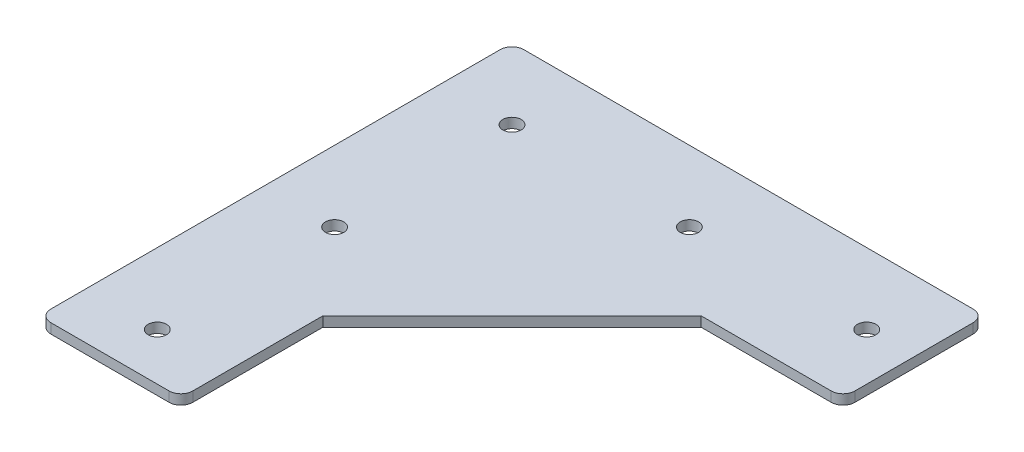
ISO-10303-21;
HEADER;
FILE_DESCRIPTION(('STEP AP214'),'2;1');
FILE_NAME('part.step','',(''),(''),'','','');
FILE_SCHEMA(('AUTOMOTIVE_DESIGN { 1 0 10303 214 1 1 1 1 }'));
ENDSEC;
DATA;
#1=APPLICATION_CONTEXT('core data for automotive mechanical design processes');
#2=APPLICATION_PROTOCOL_DEFINITION('international standard','automotive_design',2000,#1);
#3=PRODUCT_CONTEXT('',#1,'mechanical');
#4=PRODUCT('Part','Part','',(#3));
#5=PRODUCT_RELATED_PRODUCT_CATEGORY('part','',(#4));
#6=PRODUCT_DEFINITION_FORMATION('','',#4);
#7=PRODUCT_DEFINITION_CONTEXT('part definition',#1,'design');
#8=PRODUCT_DEFINITION('design','',#6,#7);
#9=PRODUCT_DEFINITION_SHAPE('','',#8);
#10=(LENGTH_UNIT() NAMED_UNIT(*) SI_UNIT(.MILLI.,.METRE.));
#11=(NAMED_UNIT(*) PLANE_ANGLE_UNIT() SI_UNIT($,.RADIAN.));
#12=(NAMED_UNIT(*) SI_UNIT($,.STERADIAN.) SOLID_ANGLE_UNIT());
#13=UNCERTAINTY_MEASURE_WITH_UNIT(LENGTH_MEASURE(1.E-05),#10,'distance_accuracy_value','');
#14=(GEOMETRIC_REPRESENTATION_CONTEXT(3) GLOBAL_UNCERTAINTY_ASSIGNED_CONTEXT((#13)) GLOBAL_UNIT_ASSIGNED_CONTEXT((#10,
#11,#12)) REPRESENTATION_CONTEXT('',''));
#15=CARTESIAN_POINT('',(0.,0.,0.));
#16=DIRECTION('',(0.,0.,1.));
#17=DIRECTION('',(1.,0.,0.));
#18=AXIS2_PLACEMENT_3D('',#15,#16,#17);
#19=CARTESIAN_POINT('',(127.,2.65684,0.));
#20=DIRECTION('',(-1.,0.,0.));
#21=DIRECTION('',(0.,0.,1.));
#22=AXIS2_PLACEMENT_3D('',#19,#20,#21);
#23=PLANE('',#22);
#24=DIRECTION('',(0.,0.,-1.));
#25=VECTOR('',#24,1.);
#26=CARTESIAN_POINT('',(127.,0.,0.));
#27=LINE('',#26,#25);
#28=CARTESIAN_POINT('',(127.,0.,-92.075));
#29=VERTEX_POINT('',#28);
#30=CARTESIAN_POINT('',(127.,0.,-123.825));
#31=VERTEX_POINT('',#30);
#32=EDGE_CURVE('E154',#29,#31,#27,.T.);
#33=ORIENTED_EDGE('',*,*,#32,.T.);
#34=DIRECTION('',(0.,-1.,0.));
#35=VECTOR('',#34,1.);
#36=CARTESIAN_POINT('',(127.,2.65684,-123.825));
#37=LINE('',#36,#35);
#38=CARTESIAN_POINT('',(127.,2.65684,-123.825));
#39=VERTEX_POINT('',#38);
#40=EDGE_CURVE('E205',#31,#39,#37,.F.);
#41=ORIENTED_EDGE('',*,*,#40,.T.);
#42=DIRECTION('',(0.,0.,-1.));
#43=VECTOR('',#42,1.);
#44=CARTESIAN_POINT('',(127.,2.65684,0.));
#45=LINE('',#44,#43);
#46=CARTESIAN_POINT('',(127.,2.65684,-92.075));
#47=VERTEX_POINT('',#46);
#48=EDGE_CURVE('E172',#47,#39,#45,.T.);
#49=ORIENTED_EDGE('',*,*,#48,.F.);
#50=DIRECTION('',(0.,-1.,0.));
#51=VECTOR('',#50,1.);
#52=CARTESIAN_POINT('',(127.,2.65684,-92.075));
#53=LINE('',#52,#51);
#54=EDGE_CURVE('E202',#47,#29,#53,.T.);
#55=ORIENTED_EDGE('',*,*,#54,.T.);
#56=EDGE_LOOP('',(#33,#41,#49,#55));
#57=FACE_BOUND('',#56,.T.);
#58=ADVANCED_FACE('F37',(#57),#23,.F.);
#59=CARTESIAN_POINT('',(0.,2.65684,-127.));
#60=DIRECTION('',(0.,0.,1.));
#61=DIRECTION('',(1.,0.,0.));
#62=AXIS2_PLACEMENT_3D('',#59,#60,#61);
#63=PLANE('',#62);
#64=DIRECTION('',(-1.,0.,0.));
#65=VECTOR('',#64,1.);
#66=CARTESIAN_POINT('',(0.,0.,-127.));
#67=LINE('',#66,#65);
#68=CARTESIAN_POINT('',(123.825,0.,-127.));
#69=VERTEX_POINT('',#68);
#70=CARTESIAN_POINT('',(3.175,0.,-127.));
#71=VERTEX_POINT('',#70);
#72=EDGE_CURVE('E157',#69,#71,#67,.T.);
#73=ORIENTED_EDGE('',*,*,#72,.T.);
#74=DIRECTION('',(0.,-1.,0.));
#75=VECTOR('',#74,1.);
#76=CARTESIAN_POINT('',(3.175,2.65684,-127.));
#77=LINE('',#76,#75);
#78=CARTESIAN_POINT('',(3.175,2.65684,-127.));
#79=VERTEX_POINT('',#78);
#80=EDGE_CURVE('E191',#71,#79,#77,.F.);
#81=ORIENTED_EDGE('',*,*,#80,.T.);
#82=DIRECTION('',(-1.,0.,0.));
#83=VECTOR('',#82,1.);
#84=CARTESIAN_POINT('',(0.,2.65684,-127.));
#85=LINE('',#84,#83);
#86=CARTESIAN_POINT('',(123.825,2.65684,-127.));
#87=VERTEX_POINT('',#86);
#88=EDGE_CURVE('E225',#87,#79,#85,.T.);
#89=ORIENTED_EDGE('',*,*,#88,.F.);
#90=DIRECTION('',(0.,-1.,0.));
#91=VECTOR('',#90,1.);
#92=CARTESIAN_POINT('',(123.825,2.65684,-127.));
#93=LINE('',#92,#91);
#94=EDGE_CURVE('E188',#87,#69,#93,.T.);
#95=ORIENTED_EDGE('',*,*,#94,.T.);
#96=EDGE_LOOP('',(#73,#81,#89,#95));
#97=FACE_BOUND('',#96,.T.);
#98=ADVANCED_FACE('F291',(#97),#63,.F.);
#99=CARTESIAN_POINT('',(0.,2.65684,0.));
#100=DIRECTION('',(-1.,0.,0.));
#101=DIRECTION('',(0.,0.,1.));
#102=AXIS2_PLACEMENT_3D('',#99,#100,#101);
#103=PLANE('',#102);
#104=DIRECTION('',(0.,0.,-1.));
#105=VECTOR('',#104,1.);
#106=CARTESIAN_POINT('',(0.,2.65684,0.));
#107=LINE('',#106,#105);
#108=CARTESIAN_POINT('',(0.,2.65684,-3.175));
#109=VERTEX_POINT('',#108);
#110=CARTESIAN_POINT('',(0.,2.65684,-123.825));
#111=VERTEX_POINT('',#110);
#112=EDGE_CURVE('E223',#109,#111,#107,.T.);
#113=ORIENTED_EDGE('',*,*,#112,.T.);
#114=DIRECTION('',(0.,-1.,0.));
#115=VECTOR('',#114,1.);
#116=CARTESIAN_POINT('',(0.,0.,-123.825));
#117=LINE('',#116,#115);
#118=CARTESIAN_POINT('',(0.,0.,-123.825));
#119=VERTEX_POINT('',#118);
#120=EDGE_CURVE('E175',#111,#119,#117,.T.);
#121=ORIENTED_EDGE('',*,*,#120,.T.);
#122=DIRECTION('',(0.,0.,-1.));
#123=VECTOR('',#122,1.);
#124=CARTESIAN_POINT('',(0.,0.,0.));
#125=LINE('',#124,#123);
#126=CARTESIAN_POINT('',(0.,0.,-3.175));
#127=VERTEX_POINT('',#126);
#128=EDGE_CURVE('E161',#127,#119,#125,.T.);
#129=ORIENTED_EDGE('',*,*,#128,.F.);
#130=DIRECTION('',(0.,-1.,0.));
#131=VECTOR('',#130,1.);
#132=CARTESIAN_POINT('',(0.,2.65684,-3.175));
#133=LINE('',#132,#131);
#134=EDGE_CURVE('E145',#127,#109,#133,.F.);
#135=ORIENTED_EDGE('',*,*,#134,.T.);
#136=EDGE_LOOP('',(#113,#121,#129,#135));
#137=FACE_BOUND('',#136,.T.);
#138=ADVANCED_FACE('F297',(#137),#103,.T.);
#139=CARTESIAN_POINT('',(0.,2.65684,0.));
#140=DIRECTION('',(0.,0.,-1.));
#141=DIRECTION('',(-1.,0.,0.));
#142=AXIS2_PLACEMENT_3D('',#139,#140,#141);
#143=PLANE('',#142);
#144=DIRECTION('',(1.,0.,0.));
#145=VECTOR('',#144,1.);
#146=CARTESIAN_POINT('',(0.,2.65684,0.));
#147=LINE('',#146,#145);
#148=CARTESIAN_POINT('',(3.175,2.65684,0.));
#149=VERTEX_POINT('',#148);
#150=CARTESIAN_POINT('',(34.925,2.65684,0.));
#151=VERTEX_POINT('',#150);
#152=EDGE_CURVE('E135',#149,#151,#147,.T.);
#153=ORIENTED_EDGE('',*,*,#152,.F.);
#154=DIRECTION('',(0.,-1.,0.));
#155=VECTOR('',#154,1.);
#156=CARTESIAN_POINT('',(3.175,0.,0.));
#157=LINE('',#156,#155);
#158=CARTESIAN_POINT('',(3.175,0.,0.));
#159=VERTEX_POINT('',#158);
#160=EDGE_CURVE('E45',#149,#159,#157,.T.);
#161=ORIENTED_EDGE('',*,*,#160,.T.);
#162=DIRECTION('',(1.,0.,0.));
#163=VECTOR('',#162,1.);
#164=CARTESIAN_POINT('',(0.,0.,0.));
#165=LINE('',#164,#163);
#166=CARTESIAN_POINT('',(34.925,0.,0.));
#167=VERTEX_POINT('',#166);
#168=EDGE_CURVE('E164',#159,#167,#165,.T.);
#169=ORIENTED_EDGE('',*,*,#168,.T.);
#170=DIRECTION('',(0.,-1.,0.));
#171=VECTOR('',#170,1.);
#172=CARTESIAN_POINT('',(34.925,2.65684,0.));
#173=LINE('',#172,#171);
#174=EDGE_CURVE('E208',#167,#151,#173,.F.);
#175=ORIENTED_EDGE('',*,*,#174,.T.);
#176=EDGE_LOOP('',(#153,#161,#169,#175));
#177=FACE_BOUND('',#176,.T.);
#178=ADVANCED_FACE('F214',(#177),#143,.F.);
#179=CARTESIAN_POINT('',(38.1,2.65684,0.));
#180=DIRECTION('',(-1.,0.,0.));
#181=DIRECTION('',(0.,0.,1.));
#182=AXIS2_PLACEMENT_3D('',#179,#180,#181);
#183=PLANE('',#182);
#184=DIRECTION('',(0.,0.,-1.));
#185=VECTOR('',#184,1.);
#186=CARTESIAN_POINT('',(38.1,2.65684,0.));
#187=LINE('',#186,#185);
#188=CARTESIAN_POINT('',(38.1,2.65684,-3.175));
#189=VERTEX_POINT('',#188);
#190=CARTESIAN_POINT('',(38.1,2.65684,-38.1));
#191=VERTEX_POINT('',#190);
#192=EDGE_CURVE('E127',#189,#191,#187,.T.);
#193=ORIENTED_EDGE('',*,*,#192,.F.);
#194=DIRECTION('',(0.,-1.,0.));
#195=VECTOR('',#194,1.);
#196=CARTESIAN_POINT('',(38.1,2.65684,-3.175));
#197=LINE('',#196,#195);
#198=CARTESIAN_POINT('',(38.1,0.,-3.175));
#199=VERTEX_POINT('',#198);
#200=EDGE_CURVE('E11',#189,#199,#197,.T.);
#201=ORIENTED_EDGE('',*,*,#200,.T.);
#202=DIRECTION('',(0.,0.,-1.));
#203=VECTOR('',#202,1.);
#204=CARTESIAN_POINT('',(38.1,0.,0.));
#205=LINE('',#204,#203);
#206=CARTESIAN_POINT('',(38.1,0.,-38.1));
#207=VERTEX_POINT('',#206);
#208=EDGE_CURVE('E141',#199,#207,#205,.T.);
#209=ORIENTED_EDGE('',*,*,#208,.T.);
#210=DIRECTION('',(0.,-1.,0.));
#211=VECTOR('',#210,1.);
#212=CARTESIAN_POINT('',(38.1,2.65684,-38.1));
#213=LINE('',#212,#211);
#214=EDGE_CURVE('E138',#191,#207,#213,.T.);
#215=ORIENTED_EDGE('',*,*,#214,.F.);
#216=EDGE_LOOP('',(#193,#201,#209,#215));
#217=FACE_BOUND('',#216,.T.);
#218=ADVANCED_FACE('F139',(#217),#183,.F.);
#219=CARTESIAN_POINT('',(0.,2.65684,0.));
#220=DIRECTION('',(0.707106781186548,0.,0.707106781186548));
#221=DIRECTION('',(0.707106781186548,0.,-0.707106781186548));
#222=AXIS2_PLACEMENT_3D('',#219,#220,#221);
#223=PLANE('',#222);
#224=DIRECTION('',(-0.707106781186548,0.,0.707106781186548));
#225=VECTOR('',#224,1.);
#226=CARTESIAN_POINT('',(0.,0.,0.));
#227=LINE('',#226,#225);
#228=CARTESIAN_POINT('',(88.9,0.,-88.9));
#229=VERTEX_POINT('',#228);
#230=EDGE_CURVE('E168',#229,#207,#227,.T.);
#231=ORIENTED_EDGE('',*,*,#230,.F.);
#232=DIRECTION('',(0.,-1.,0.));
#233=VECTOR('',#232,1.);
#234=CARTESIAN_POINT('',(88.9,2.65684,-88.9));
#235=LINE('',#234,#233);
#236=CARTESIAN_POINT('',(88.9,2.65684,-88.9));
#237=VERTEX_POINT('',#236);
#238=EDGE_CURVE('E146',#237,#229,#235,.T.);
#239=ORIENTED_EDGE('',*,*,#238,.F.);
#240=DIRECTION('',(-0.707106781186548,0.,0.707106781186548));
#241=VECTOR('',#240,1.);
#242=CARTESIAN_POINT('',(0.,2.65684,0.));
#243=LINE('',#242,#241);
#244=EDGE_CURVE('E132',#237,#191,#243,.T.);
#245=ORIENTED_EDGE('',*,*,#244,.T.);
#246=ORIENTED_EDGE('',*,*,#214,.T.);
#247=EDGE_LOOP('',(#231,#239,#245,#246));
#248=FACE_BOUND('',#247,.T.);
#249=ADVANCED_FACE('F148',(#248),#223,.T.);
#250=CARTESIAN_POINT('',(0.,2.65684,-88.9));
#251=DIRECTION('',(0.,0.,-1.));
#252=DIRECTION('',(-1.,0.,0.));
#253=AXIS2_PLACEMENT_3D('',#250,#251,#252);
#254=PLANE('',#253);
#255=DIRECTION('',(1.,0.,0.));
#256=VECTOR('',#255,1.);
#257=CARTESIAN_POINT('',(0.,0.,-88.9));
#258=LINE('',#257,#256);
#259=CARTESIAN_POINT('',(123.825,0.,-88.9));
#260=VERTEX_POINT('',#259);
#261=EDGE_CURVE('E170',#229,#260,#258,.T.);
#262=ORIENTED_EDGE('',*,*,#261,.T.);
#263=DIRECTION('',(0.,-1.,0.));
#264=VECTOR('',#263,1.);
#265=CARTESIAN_POINT('',(123.825,2.65684,-88.9));
#266=LINE('',#265,#264);
#267=CARTESIAN_POINT('',(123.825,2.65684,-88.9));
#268=VERTEX_POINT('',#267);
#269=EDGE_CURVE('E52',#260,#268,#266,.F.);
#270=ORIENTED_EDGE('',*,*,#269,.T.);
#271=DIRECTION('',(1.,0.,0.));
#272=VECTOR('',#271,1.);
#273=CARTESIAN_POINT('',(0.,2.65684,-88.9));
#274=LINE('',#273,#272);
#275=EDGE_CURVE('E149',#237,#268,#274,.T.);
#276=ORIENTED_EDGE('',*,*,#275,.F.);
#277=ORIENTED_EDGE('',*,*,#238,.T.);
#278=EDGE_LOOP('',(#262,#270,#276,#277));
#279=FACE_BOUND('',#278,.T.);
#280=ADVANCED_FACE('F265',(#279),#254,.F.);
#281=CARTESIAN_POINT('',(0.,2.65684,0.));
#282=DIRECTION('',(0.,1.,0.));
#283=DIRECTION('',(0.,0.,1.));
#284=AXIS2_PLACEMENT_3D('',#281,#282,#283);
#285=PLANE('',#284);
#286=CARTESIAN_POINT('',(114.3,2.65684,-107.95));
#287=DIRECTION('',(0.,1.,0.));
#288=DIRECTION('',(0.,0.,1.));
#289=AXIS2_PLACEMENT_3D('',#286,#287,#288);
#290=CIRCLE('',#289,2.45745);
#291=CARTESIAN_POINT('',(114.3,2.65684,-105.49255));
#292=VERTEX_POINT('',#291);
#293=EDGE_CURVE('E257',#292,#292,#290,.T.);
#294=ORIENTED_EDGE('',*,*,#293,.F.);
#295=EDGE_LOOP('',(#294));
#296=FACE_BOUND('',#295,.T.);
#297=CARTESIAN_POINT('',(66.675,2.65684,-107.95));
#298=DIRECTION('',(0.,1.,0.));
#299=DIRECTION('',(0.,0.,1.));
#300=AXIS2_PLACEMENT_3D('',#297,#298,#299);
#301=CIRCLE('',#300,2.45745);
#302=CARTESIAN_POINT('',(66.675,2.65684,-105.49255));
#303=VERTEX_POINT('',#302);
#304=EDGE_CURVE('E251',#303,#303,#301,.T.);
#305=ORIENTED_EDGE('',*,*,#304,.F.);
#306=EDGE_LOOP('',(#305));
#307=FACE_BOUND('',#306,.T.);
#308=CARTESIAN_POINT('',(19.05,2.65684,-107.95));
#309=DIRECTION('',(0.,1.,0.));
#310=DIRECTION('',(0.,0.,1.));
#311=AXIS2_PLACEMENT_3D('',#308,#309,#310);
#312=CIRCLE('',#311,2.45744999999999);
#313=CARTESIAN_POINT('',(19.05,2.65684,-105.49255));
#314=VERTEX_POINT('',#313);
#315=EDGE_CURVE('E245',#314,#314,#312,.T.);
#316=ORIENTED_EDGE('',*,*,#315,.F.);
#317=EDGE_LOOP('',(#316));
#318=FACE_BOUND('',#317,.T.);
#319=CARTESIAN_POINT('',(19.05,2.65684,-60.325));
#320=DIRECTION('',(0.,1.,0.));
#321=DIRECTION('',(0.,0.,1.));
#322=AXIS2_PLACEMENT_3D('',#319,#320,#321);
#323=CIRCLE('',#322,2.45744999999999);
#324=CARTESIAN_POINT('',(19.05,2.65684,-57.86755));
#325=VERTEX_POINT('',#324);
#326=EDGE_CURVE('E239',#325,#325,#323,.T.);
#327=ORIENTED_EDGE('',*,*,#326,.F.);
#328=EDGE_LOOP('',(#327));
#329=FACE_BOUND('',#328,.T.);
#330=CARTESIAN_POINT('',(19.05,2.65684,-12.7));
#331=DIRECTION('',(0.,1.,0.));
#332=DIRECTION('',(0.,0.,1.));
#333=AXIS2_PLACEMENT_3D('',#330,#331,#332);
#334=CIRCLE('',#333,2.45744999999999);
#335=CARTESIAN_POINT('',(19.05,2.65684,-10.24255));
#336=VERTEX_POINT('',#335);
#337=EDGE_CURVE('E233',#336,#336,#334,.T.);
#338=ORIENTED_EDGE('',*,*,#337,.F.);
#339=EDGE_LOOP('',(#338));
#340=FACE_BOUND('',#339,.T.);
#341=ORIENTED_EDGE('',*,*,#88,.T.);
#342=CARTESIAN_POINT('',(3.175,2.65684,-123.825));
#343=DIRECTION('',(0.,1.,0.));
#344=DIRECTION('',(0.,0.,1.));
#345=AXIS2_PLACEMENT_3D('',#342,#343,#344);
#346=CIRCLE('',#345,3.175);
#347=EDGE_CURVE('E200',#79,#111,#346,.T.);
#348=ORIENTED_EDGE('',*,*,#347,.T.);
#349=ORIENTED_EDGE('',*,*,#112,.F.);
#350=CARTESIAN_POINT('',(3.175,2.65684,-3.175));
#351=DIRECTION('',(0.,1.,0.));
#352=DIRECTION('',(0.,0.,1.));
#353=AXIS2_PLACEMENT_3D('',#350,#351,#352);
#354=CIRCLE('',#353,3.175);
#355=EDGE_CURVE('E194',#109,#149,#354,.T.);
#356=ORIENTED_EDGE('',*,*,#355,.T.);
#357=ORIENTED_EDGE('',*,*,#152,.T.);
#358=CARTESIAN_POINT('',(34.925,2.65684,-3.175));
#359=DIRECTION('',(0.,1.,0.));
#360=DIRECTION('',(0.,0.,1.));
#361=AXIS2_PLACEMENT_3D('',#358,#359,#360);
#362=CIRCLE('',#361,3.175);
#363=EDGE_CURVE('E60',#151,#189,#362,.T.);
#364=ORIENTED_EDGE('',*,*,#363,.T.);
#365=ORIENTED_EDGE('',*,*,#192,.T.);
#366=ORIENTED_EDGE('',*,*,#244,.F.);
#367=ORIENTED_EDGE('',*,*,#275,.T.);
#368=CARTESIAN_POINT('',(123.825,2.65684,-92.075));
#369=DIRECTION('',(0.,1.,0.));
#370=DIRECTION('',(0.,0.,1.));
#371=AXIS2_PLACEMENT_3D('',#368,#369,#370);
#372=CIRCLE('',#371,3.175);
#373=EDGE_CURVE('E196',#268,#47,#372,.T.);
#374=ORIENTED_EDGE('',*,*,#373,.T.);
#375=ORIENTED_EDGE('',*,*,#48,.T.);
#376=CARTESIAN_POINT('',(123.825,2.65684,-123.825));
#377=DIRECTION('',(0.,1.,0.));
#378=DIRECTION('',(0.,0.,1.));
#379=AXIS2_PLACEMENT_3D('',#376,#377,#378);
#380=CIRCLE('',#379,3.175);
#381=EDGE_CURVE('E198',#39,#87,#380,.T.);
#382=ORIENTED_EDGE('',*,*,#381,.T.);
#383=EDGE_LOOP('',(#341,#348,#349,#356,#357,#364,#365,#366,#367,#374,#375,#382));
#384=FACE_BOUND('',#383,.T.);
#385=ADVANCED_FACE('F130',(#296,#307,#318,#329,#340,#384),#285,.T.);
#386=CARTESIAN_POINT('',(0.,0.,0.));
#387=DIRECTION('',(0.,1.,0.));
#388=DIRECTION('',(0.,0.,1.));
#389=AXIS2_PLACEMENT_3D('',#386,#387,#388);
#390=PLANE('',#389);
#391=CARTESIAN_POINT('',(114.3,0.,-107.95));
#392=DIRECTION('',(0.,1.,0.));
#393=DIRECTION('',(0.,0.,1.));
#394=AXIS2_PLACEMENT_3D('',#391,#392,#393);
#395=CIRCLE('',#394,2.45745);
#396=CARTESIAN_POINT('',(114.3,0.,-105.49255));
#397=VERTEX_POINT('',#396);
#398=EDGE_CURVE('E254',#397,#397,#395,.T.);
#399=ORIENTED_EDGE('',*,*,#398,.T.);
#400=EDGE_LOOP('',(#399));
#401=FACE_BOUND('',#400,.T.);
#402=CARTESIAN_POINT('',(66.675,0.,-107.95));
#403=DIRECTION('',(0.,1.,0.));
#404=DIRECTION('',(0.,0.,1.));
#405=AXIS2_PLACEMENT_3D('',#402,#403,#404);
#406=CIRCLE('',#405,2.45745);
#407=CARTESIAN_POINT('',(66.675,0.,-105.49255));
#408=VERTEX_POINT('',#407);
#409=EDGE_CURVE('E248',#408,#408,#406,.T.);
#410=ORIENTED_EDGE('',*,*,#409,.T.);
#411=EDGE_LOOP('',(#410));
#412=FACE_BOUND('',#411,.T.);
#413=CARTESIAN_POINT('',(19.05,0.,-107.95));
#414=DIRECTION('',(0.,1.,0.));
#415=DIRECTION('',(0.,0.,1.));
#416=AXIS2_PLACEMENT_3D('',#413,#414,#415);
#417=CIRCLE('',#416,2.45745);
#418=CARTESIAN_POINT('',(19.05,0.,-105.49255));
#419=VERTEX_POINT('',#418);
#420=EDGE_CURVE('E242',#419,#419,#417,.T.);
#421=ORIENTED_EDGE('',*,*,#420,.T.);
#422=EDGE_LOOP('',(#421));
#423=FACE_BOUND('',#422,.T.);
#424=CARTESIAN_POINT('',(19.05,0.,-60.325));
#425=DIRECTION('',(0.,1.,0.));
#426=DIRECTION('',(0.,0.,1.));
#427=AXIS2_PLACEMENT_3D('',#424,#425,#426);
#428=CIRCLE('',#427,2.45745);
#429=CARTESIAN_POINT('',(19.05,0.,-57.86755));
#430=VERTEX_POINT('',#429);
#431=EDGE_CURVE('E236',#430,#430,#428,.T.);
#432=ORIENTED_EDGE('',*,*,#431,.T.);
#433=EDGE_LOOP('',(#432));
#434=FACE_BOUND('',#433,.T.);
#435=CARTESIAN_POINT('',(19.05,0.,-12.7));
#436=DIRECTION('',(0.,1.,0.));
#437=DIRECTION('',(0.,0.,1.));
#438=AXIS2_PLACEMENT_3D('',#435,#436,#437);
#439=CIRCLE('',#438,2.45745);
#440=CARTESIAN_POINT('',(19.05,0.,-10.24255));
#441=VERTEX_POINT('',#440);
#442=EDGE_CURVE('E158',#441,#441,#439,.T.);
#443=ORIENTED_EDGE('',*,*,#442,.T.);
#444=EDGE_LOOP('',(#443));
#445=FACE_BOUND('',#444,.T.);
#446=ORIENTED_EDGE('',*,*,#128,.T.);
#447=CARTESIAN_POINT('',(3.175,0.,-123.825));
#448=DIRECTION('',(0.,1.,0.));
#449=DIRECTION('',(0.,0.,1.));
#450=AXIS2_PLACEMENT_3D('',#447,#448,#449);
#451=CIRCLE('',#450,3.175);
#452=EDGE_CURVE('E186',#119,#71,#451,.F.);
#453=ORIENTED_EDGE('',*,*,#452,.T.);
#454=ORIENTED_EDGE('',*,*,#72,.F.);
#455=CARTESIAN_POINT('',(123.825,0.,-123.825));
#456=DIRECTION('',(0.,1.,0.));
#457=DIRECTION('',(0.,0.,1.));
#458=AXIS2_PLACEMENT_3D('',#455,#456,#457);
#459=CIRCLE('',#458,3.175);
#460=EDGE_CURVE('E184',#69,#31,#459,.F.);
#461=ORIENTED_EDGE('',*,*,#460,.T.);
#462=ORIENTED_EDGE('',*,*,#32,.F.);
#463=CARTESIAN_POINT('',(123.825,0.,-92.075));
#464=DIRECTION('',(0.,1.,0.));
#465=DIRECTION('',(0.,0.,1.));
#466=AXIS2_PLACEMENT_3D('',#463,#464,#465);
#467=CIRCLE('',#466,3.175);
#468=EDGE_CURVE('E182',#29,#260,#467,.F.);
#469=ORIENTED_EDGE('',*,*,#468,.T.);
#470=ORIENTED_EDGE('',*,*,#261,.F.);
#471=ORIENTED_EDGE('',*,*,#230,.T.);
#472=ORIENTED_EDGE('',*,*,#208,.F.);
#473=CARTESIAN_POINT('',(34.925,0.,-3.175));
#474=DIRECTION('',(0.,1.,0.));
#475=DIRECTION('',(0.,0.,1.));
#476=AXIS2_PLACEMENT_3D('',#473,#474,#475);
#477=CIRCLE('',#476,3.175);
#478=EDGE_CURVE('E178',#199,#167,#477,.F.);
#479=ORIENTED_EDGE('',*,*,#478,.T.);
#480=ORIENTED_EDGE('',*,*,#168,.F.);
#481=CARTESIAN_POINT('',(3.175,0.,-3.175));
#482=DIRECTION('',(0.,1.,0.));
#483=DIRECTION('',(0.,0.,1.));
#484=AXIS2_PLACEMENT_3D('',#481,#482,#483);
#485=CIRCLE('',#484,3.175);
#486=EDGE_CURVE('E180',#159,#127,#485,.F.);
#487=ORIENTED_EDGE('',*,*,#486,.T.);
#488=EDGE_LOOP('',(#446,#453,#454,#461,#462,#469,#470,#471,#472,#479,#480,#487));
#489=FACE_BOUND('',#488,.T.);
#490=ADVANCED_FACE('F219',(#401,#412,#423,#434,#445,#489),#390,.F.);
#491=CARTESIAN_POINT('',(19.05,2.65684,-12.7));
#492=DIRECTION('',(0.,1.,0.));
#493=DIRECTION('',(0.,0.,1.));
#494=AXIS2_PLACEMENT_3D('',#491,#492,#493);
#495=CYLINDRICAL_SURFACE('',#494,2.45745);
#496=ORIENTED_EDGE('',*,*,#442,.F.);
#497=EDGE_LOOP('',(#496));
#498=FACE_BOUND('',#497,.T.);
#499=ORIENTED_EDGE('',*,*,#337,.T.);
#500=EDGE_LOOP('',(#499));
#501=FACE_BOUND('',#500,.T.);
#502=ADVANCED_FACE('F275',(#498,#501),#495,.F.);
#503=CARTESIAN_POINT('',(19.05,2.65684,-60.325));
#504=DIRECTION('',(0.,1.,0.));
#505=DIRECTION('',(0.,0.,1.));
#506=AXIS2_PLACEMENT_3D('',#503,#504,#505);
#507=CYLINDRICAL_SURFACE('',#506,2.45745);
#508=ORIENTED_EDGE('',*,*,#431,.F.);
#509=EDGE_LOOP('',(#508));
#510=FACE_BOUND('',#509,.T.);
#511=ORIENTED_EDGE('',*,*,#326,.T.);
#512=EDGE_LOOP('',(#511));
#513=FACE_BOUND('',#512,.T.);
#514=ADVANCED_FACE('F277',(#510,#513),#507,.F.);
#515=CARTESIAN_POINT('',(19.05,2.65684,-107.95));
#516=DIRECTION('',(0.,1.,0.));
#517=DIRECTION('',(0.,0.,1.));
#518=AXIS2_PLACEMENT_3D('',#515,#516,#517);
#519=CYLINDRICAL_SURFACE('',#518,2.45745);
#520=ORIENTED_EDGE('',*,*,#420,.F.);
#521=EDGE_LOOP('',(#520));
#522=FACE_BOUND('',#521,.T.);
#523=ORIENTED_EDGE('',*,*,#315,.T.);
#524=EDGE_LOOP('',(#523));
#525=FACE_BOUND('',#524,.T.);
#526=ADVANCED_FACE('F284',(#522,#525),#519,.F.);
#527=CARTESIAN_POINT('',(66.675,2.65684,-107.95));
#528=DIRECTION('',(0.,1.,0.));
#529=DIRECTION('',(0.,0.,1.));
#530=AXIS2_PLACEMENT_3D('',#527,#528,#529);
#531=CYLINDRICAL_SURFACE('',#530,2.45745);
#532=ORIENTED_EDGE('',*,*,#409,.F.);
#533=EDGE_LOOP('',(#532));
#534=FACE_BOUND('',#533,.T.);
#535=ORIENTED_EDGE('',*,*,#304,.T.);
#536=EDGE_LOOP('',(#535));
#537=FACE_BOUND('',#536,.T.);
#538=ADVANCED_FACE('F381',(#534,#537),#531,.F.);
#539=CARTESIAN_POINT('',(114.3,2.65684,-107.95));
#540=DIRECTION('',(0.,1.,0.));
#541=DIRECTION('',(0.,0.,1.));
#542=AXIS2_PLACEMENT_3D('',#539,#540,#541);
#543=CYLINDRICAL_SURFACE('',#542,2.45745);
#544=ORIENTED_EDGE('',*,*,#398,.F.);
#545=EDGE_LOOP('',(#544));
#546=FACE_BOUND('',#545,.T.);
#547=ORIENTED_EDGE('',*,*,#293,.T.);
#548=EDGE_LOOP('',(#547));
#549=FACE_BOUND('',#548,.T.);
#550=ADVANCED_FACE('F261',(#546,#549),#543,.F.);
#551=CARTESIAN_POINT('',(3.175,2.65684,-123.825));
#552=DIRECTION('',(0.,1.,0.));
#553=DIRECTION('',(0.,0.,1.));
#554=AXIS2_PLACEMENT_3D('',#551,#552,#553);
#555=CYLINDRICAL_SURFACE('',#554,3.175);
#556=ORIENTED_EDGE('',*,*,#347,.F.);
#557=ORIENTED_EDGE('',*,*,#80,.F.);
#558=ORIENTED_EDGE('',*,*,#452,.F.);
#559=ORIENTED_EDGE('',*,*,#120,.F.);
#560=EDGE_LOOP('',(#556,#557,#558,#559));
#561=FACE_BOUND('',#560,.T.);
#562=ADVANCED_FACE('F302',(#561),#555,.T.);
#563=CARTESIAN_POINT('',(123.825,2.65684,-123.825));
#564=DIRECTION('',(0.,-1.,0.));
#565=DIRECTION('',(0.,0.,-1.));
#566=AXIS2_PLACEMENT_3D('',#563,#564,#565);
#567=CYLINDRICAL_SURFACE('',#566,3.175);
#568=ORIENTED_EDGE('',*,*,#381,.F.);
#569=ORIENTED_EDGE('',*,*,#40,.F.);
#570=ORIENTED_EDGE('',*,*,#460,.F.);
#571=ORIENTED_EDGE('',*,*,#94,.F.);
#572=EDGE_LOOP('',(#568,#569,#570,#571));
#573=FACE_BOUND('',#572,.T.);
#574=ADVANCED_FACE('F305',(#573),#567,.T.);
#575=CARTESIAN_POINT('',(123.825,2.65684,-92.075));
#576=DIRECTION('',(0.,-1.,0.));
#577=DIRECTION('',(0.,0.,-1.));
#578=AXIS2_PLACEMENT_3D('',#575,#576,#577);
#579=CYLINDRICAL_SURFACE('',#578,3.175);
#580=ORIENTED_EDGE('',*,*,#373,.F.);
#581=ORIENTED_EDGE('',*,*,#269,.F.);
#582=ORIENTED_EDGE('',*,*,#468,.F.);
#583=ORIENTED_EDGE('',*,*,#54,.F.);
#584=EDGE_LOOP('',(#580,#581,#582,#583));
#585=FACE_BOUND('',#584,.T.);
#586=ADVANCED_FACE('F309',(#585),#579,.T.);
#587=CARTESIAN_POINT('',(3.175,2.65684,-3.175));
#588=DIRECTION('',(0.,1.,0.));
#589=DIRECTION('',(0.,0.,1.));
#590=AXIS2_PLACEMENT_3D('',#587,#588,#589);
#591=CYLINDRICAL_SURFACE('',#590,3.175);
#592=ORIENTED_EDGE('',*,*,#355,.F.);
#593=ORIENTED_EDGE('',*,*,#134,.F.);
#594=ORIENTED_EDGE('',*,*,#486,.F.);
#595=ORIENTED_EDGE('',*,*,#160,.F.);
#596=EDGE_LOOP('',(#592,#593,#594,#595));
#597=FACE_BOUND('',#596,.T.);
#598=ADVANCED_FACE('F312',(#597),#591,.T.);
#599=CARTESIAN_POINT('',(34.925,2.65684,-3.175));
#600=DIRECTION('',(0.,-1.,0.));
#601=DIRECTION('',(0.,0.,-1.));
#602=AXIS2_PLACEMENT_3D('',#599,#600,#601);
#603=CYLINDRICAL_SURFACE('',#602,3.175);
#604=ORIENTED_EDGE('',*,*,#363,.F.);
#605=ORIENTED_EDGE('',*,*,#174,.F.);
#606=ORIENTED_EDGE('',*,*,#478,.F.);
#607=ORIENTED_EDGE('',*,*,#200,.F.);
#608=EDGE_LOOP('',(#604,#605,#606,#607));
#609=FACE_BOUND('',#608,.T.);
#610=ADVANCED_FACE('F39',(#609),#603,.T.);
#611=CLOSED_SHELL('',(#58,#98,#138,#178,#218,#249,#280,#385,#490,#502,#514,#526,#538,#550,#562,
#574,#586,#598,#610));
#612=MANIFOLD_SOLID_BREP('B2',#611);
#613=ADVANCED_BREP_SHAPE_REPRESENTATION('',(#18,#612),#14);
#614=SHAPE_DEFINITION_REPRESENTATION(#9,#613);
ENDSEC;
END-ISO-10303-21;
